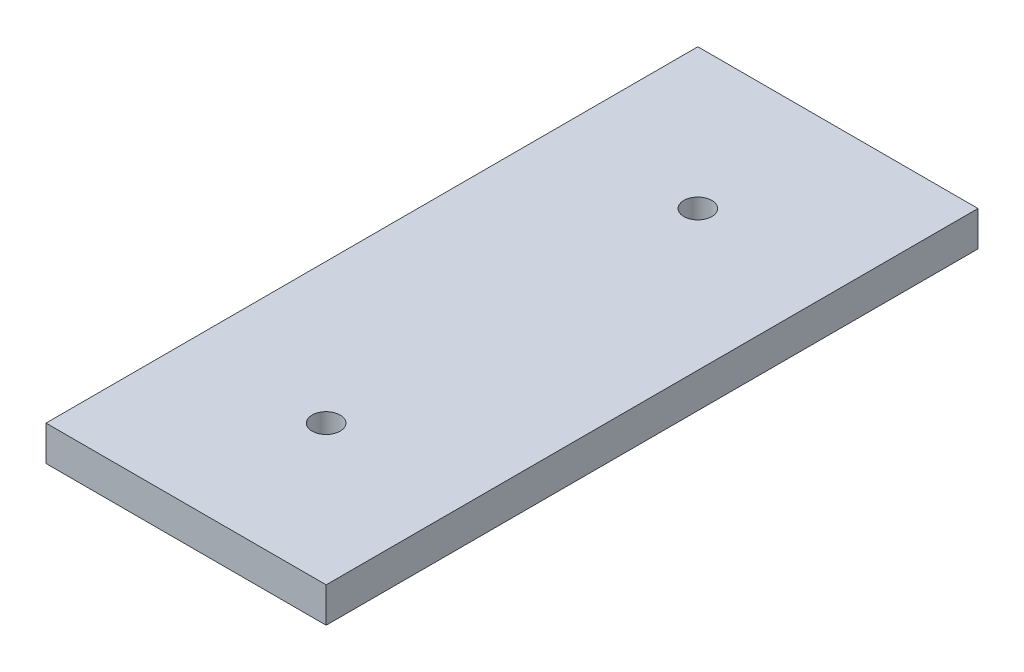
ISO-10303-21;
HEADER;
FILE_DESCRIPTION(('STEP AP214'),'2;1');
FILE_NAME('part.step','',(''),(''),'','','');
FILE_SCHEMA(('AUTOMOTIVE_DESIGN { 1 0 10303 214 1 1 1 1 }'));
ENDSEC;
DATA;
#1=APPLICATION_CONTEXT('core data for automotive mechanical design processes');
#2=APPLICATION_PROTOCOL_DEFINITION('international standard','automotive_design',2000,#1);
#3=PRODUCT_CONTEXT('',#1,'mechanical');
#4=PRODUCT('Part','Part','',(#3));
#5=PRODUCT_RELATED_PRODUCT_CATEGORY('part','',(#4));
#6=PRODUCT_DEFINITION_FORMATION('','',#4);
#7=PRODUCT_DEFINITION_CONTEXT('part definition',#1,'design');
#8=PRODUCT_DEFINITION('design','',#6,#7);
#9=PRODUCT_DEFINITION_SHAPE('','',#8);
#10=(LENGTH_UNIT() NAMED_UNIT(*) SI_UNIT(.MILLI.,.METRE.));
#11=(NAMED_UNIT(*) PLANE_ANGLE_UNIT() SI_UNIT($,.RADIAN.));
#12=(NAMED_UNIT(*) SI_UNIT($,.STERADIAN.) SOLID_ANGLE_UNIT());
#13=UNCERTAINTY_MEASURE_WITH_UNIT(LENGTH_MEASURE(1.E-05),#10,'distance_accuracy_value','');
#14=(GEOMETRIC_REPRESENTATION_CONTEXT(3) GLOBAL_UNCERTAINTY_ASSIGNED_CONTEXT((#13)) GLOBAL_UNIT_ASSIGNED_CONTEXT((#10,
#11,#12)) REPRESENTATION_CONTEXT('',''));
#15=CARTESIAN_POINT('',(0.,0.,0.));
#16=DIRECTION('',(0.,0.,1.));
#17=DIRECTION('',(1.,0.,0.));
#18=AXIS2_PLACEMENT_3D('',#15,#16,#17);
#19=CARTESIAN_POINT('',(0.,-2.5,-11.5342917352885));
#20=DIRECTION('',(0.,1.,0.));
#21=DIRECTION('',(0.,0.,1.));
#22=AXIS2_PLACEMENT_3D('',#19,#20,#21);
#23=PLANE('',#22);
#24=CARTESIAN_POINT('',(0.,-2.50000000000009,-24.0342917352885));
#25=DIRECTION('',(0.,1.,0.));
#26=DIRECTION('',(0.,0.,1.));
#27=AXIS2_PLACEMENT_3D('',#24,#25,#26);
#28=CIRCLE('',#27,1.);
#29=CARTESIAN_POINT('',(0.,-2.50000000000008,-23.0342917352885));
#30=VERTEX_POINT('',#29);
#31=EDGE_CURVE('E157',#30,#30,#28,.F.);
#32=ORIENTED_EDGE('',*,*,#31,.F.);
#33=EDGE_LOOP('',(#32));
#34=FACE_BOUND('',#33,.T.);
#35=DIRECTION('',(0.,0.,1.));
#36=VECTOR('',#35,1.);
#37=CARTESIAN_POINT('',(10.,-2.5,-11.5342917352885));
#38=LINE('',#37,#36);
#39=CARTESIAN_POINT('',(10.,-2.50000000000016,-34.0342917352885));
#40=VERTEX_POINT('',#39);
#41=CARTESIAN_POINT('',(10.,-2.5,12.5));
#42=VERTEX_POINT('',#41);
#43=EDGE_CURVE('E115',#40,#42,#38,.T.);
#44=ORIENTED_EDGE('',*,*,#43,.T.);
#45=DIRECTION('',(1.,0.,0.));
#46=VECTOR('',#45,1.);
#47=CARTESIAN_POINT('',(-9.99999999999999,-2.5,12.5));
#48=LINE('',#47,#46);
#49=CARTESIAN_POINT('',(-9.99999999999999,-2.5,12.5));
#50=VERTEX_POINT('',#49);
#51=EDGE_CURVE('E133',#50,#42,#48,.T.);
#52=ORIENTED_EDGE('',*,*,#51,.F.);
#53=DIRECTION('',(0.,0.,-1.));
#54=VECTOR('',#53,1.);
#55=CARTESIAN_POINT('',(-10.,-2.5,-11.5342917352885));
#56=LINE('',#55,#54);
#57=CARTESIAN_POINT('',(-10.,-2.50000000000016,-34.0342917352885));
#58=VERTEX_POINT('',#57);
#59=EDGE_CURVE('E109',#50,#58,#56,.T.);
#60=ORIENTED_EDGE('',*,*,#59,.T.);
#61=DIRECTION('',(1.,0.,0.));
#62=VECTOR('',#61,1.);
#63=CARTESIAN_POINT('',(0.,-2.50000000000016,-34.0342917352885));
#64=LINE('',#63,#62);
#65=EDGE_CURVE('E87',#58,#40,#64,.T.);
#66=ORIENTED_EDGE('',*,*,#65,.T.);
#67=EDGE_LOOP('',(#44,#52,#60,#66));
#68=FACE_BOUND('',#67,.T.);
#69=CARTESIAN_POINT('',(0.,-2.5,2.5));
#70=DIRECTION('',(0.,1.,0.));
#71=DIRECTION('',(0.,0.,1.));
#72=AXIS2_PLACEMENT_3D('',#69,#70,#71);
#73=CIRCLE('',#72,1.);
#74=CARTESIAN_POINT('',(0.,-2.5,3.5));
#75=VERTEX_POINT('',#74);
#76=EDGE_CURVE('E139',#75,#75,#73,.T.);
#77=ORIENTED_EDGE('',*,*,#76,.T.);
#78=EDGE_LOOP('',(#77));
#79=FACE_BOUND('',#78,.T.);
#80=ADVANCED_FACE('F68',(#34,#68,#79),#23,.F.);
#81=CARTESIAN_POINT('',(0.,0.,0.));
#82=DIRECTION('',(0.,-1.,0.));
#83=DIRECTION('',(0.,0.,-1.));
#84=AXIS2_PLACEMENT_3D('',#81,#82,#83);
#85=PLANE('',#84);
#86=CARTESIAN_POINT('',(0.,0.,-24.0342917352885));
#87=DIRECTION('',(0.,1.,0.));
#88=DIRECTION('',(0.,0.,1.));
#89=AXIS2_PLACEMENT_3D('',#86,#87,#88);
#90=CIRCLE('',#89,1.);
#91=CARTESIAN_POINT('',(0.,0.,-23.0342917352885));
#92=VERTEX_POINT('',#91);
#93=EDGE_CURVE('E72',#92,#92,#90,.F.);
#94=ORIENTED_EDGE('',*,*,#93,.T.);
#95=EDGE_LOOP('',(#94));
#96=FACE_BOUND('',#95,.T.);
#97=DIRECTION('',(0.,0.,1.));
#98=VECTOR('',#97,1.);
#99=CARTESIAN_POINT('',(-10.,-1.57859836313889E-13,-34.0342917352885));
#100=LINE('',#99,#98);
#101=CARTESIAN_POINT('',(-9.99999999999999,0.,12.5));
#102=VERTEX_POINT('',#101);
#103=CARTESIAN_POINT('',(-10.,-1.57859836313889E-13,-34.0342917352885));
#104=VERTEX_POINT('',#103);
#105=EDGE_CURVE('E105',#102,#104,#100,.F.);
#106=ORIENTED_EDGE('',*,*,#105,.F.);
#107=DIRECTION('',(1.,0.,0.));
#108=VECTOR('',#107,1.);
#109=CARTESIAN_POINT('',(-9.99999999999999,0.,12.5));
#110=LINE('',#109,#108);
#111=CARTESIAN_POINT('',(10.,0.,12.5));
#112=VERTEX_POINT('',#111);
#113=EDGE_CURVE('E132',#102,#112,#110,.T.);
#114=ORIENTED_EDGE('',*,*,#113,.T.);
#115=DIRECTION('',(0.,0.,-1.));
#116=VECTOR('',#115,1.);
#117=CARTESIAN_POINT('',(10.,0.,-11.5342917352885));
#118=LINE('',#117,#116);
#119=CARTESIAN_POINT('',(10.,-1.57859836313889E-13,-34.0342917352885));
#120=VERTEX_POINT('',#119);
#121=EDGE_CURVE('E120',#120,#112,#118,.F.);
#122=ORIENTED_EDGE('',*,*,#121,.F.);
#123=DIRECTION('',(-1.,0.,0.));
#124=VECTOR('',#123,1.);
#125=CARTESIAN_POINT('',(10.,-1.57859836313889E-13,-34.0342917352885));
#126=LINE('',#125,#124);
#127=EDGE_CURVE('E97',#104,#120,#126,.F.);
#128=ORIENTED_EDGE('',*,*,#127,.F.);
#129=EDGE_LOOP('',(#106,#114,#122,#128));
#130=FACE_BOUND('',#129,.T.);
#131=CARTESIAN_POINT('',(0.,0.,2.5));
#132=DIRECTION('',(0.,1.,0.));
#133=DIRECTION('',(0.,0.,1.));
#134=AXIS2_PLACEMENT_3D('',#131,#132,#133);
#135=CIRCLE('',#134,1.);
#136=CARTESIAN_POINT('',(0.,0.,3.5));
#137=VERTEX_POINT('',#136);
#138=EDGE_CURVE('E134',#137,#137,#135,.T.);
#139=ORIENTED_EDGE('',*,*,#138,.F.);
#140=EDGE_LOOP('',(#139));
#141=FACE_BOUND('',#140,.T.);
#142=ADVANCED_FACE('F70',(#96,#130,#141),#85,.F.);
#143=CARTESIAN_POINT('',(-10.,-2.50000000000016,-34.0342917352885));
#144=DIRECTION('',(1.,0.,0.));
#145=DIRECTION('',(0.,-1.,0.));
#146=AXIS2_PLACEMENT_3D('',#143,#144,#145);
#147=PLANE('',#146);
#148=ORIENTED_EDGE('',*,*,#59,.F.);
#149=DIRECTION('',(0.,1.,0.));
#150=VECTOR('',#149,1.);
#151=CARTESIAN_POINT('',(-9.99999999999999,-2.5,12.5));
#152=LINE('',#151,#150);
#153=EDGE_CURVE('E138',#50,#102,#152,.T.);
#154=ORIENTED_EDGE('',*,*,#153,.T.);
#155=ORIENTED_EDGE('',*,*,#105,.T.);
#156=DIRECTION('',(0.,1.,0.));
#157=VECTOR('',#156,1.);
#158=CARTESIAN_POINT('',(-10.,-2.50000000000016,-34.0342917352885));
#159=LINE('',#158,#157);
#160=EDGE_CURVE('E14',#58,#104,#159,.T.);
#161=ORIENTED_EDGE('',*,*,#160,.F.);
#162=EDGE_LOOP('',(#148,#154,#155,#161));
#163=FACE_BOUND('',#162,.T.);
#164=ADVANCED_FACE('F184',(#163),#147,.F.);
#165=CARTESIAN_POINT('',(10.,-2.5,-11.5342917352885));
#166=DIRECTION('',(-1.,0.,0.));
#167=DIRECTION('',(0.,1.,0.));
#168=AXIS2_PLACEMENT_3D('',#165,#166,#167);
#169=PLANE('',#168);
#170=ORIENTED_EDGE('',*,*,#121,.T.);
#171=DIRECTION('',(0.,1.,0.));
#172=VECTOR('',#171,1.);
#173=CARTESIAN_POINT('',(10.,-2.5,12.5));
#174=LINE('',#173,#172);
#175=EDGE_CURVE('E123',#42,#112,#174,.T.);
#176=ORIENTED_EDGE('',*,*,#175,.F.);
#177=ORIENTED_EDGE('',*,*,#43,.F.);
#178=DIRECTION('',(0.,1.,0.));
#179=VECTOR('',#178,1.);
#180=CARTESIAN_POINT('',(10.,-2.50000000000016,-34.0342917352885));
#181=LINE('',#180,#179);
#182=EDGE_CURVE('E78',#40,#120,#181,.T.);
#183=ORIENTED_EDGE('',*,*,#182,.T.);
#184=EDGE_LOOP('',(#170,#176,#177,#183));
#185=FACE_BOUND('',#184,.T.);
#186=ADVANCED_FACE('F122',(#185),#169,.F.);
#187=CARTESIAN_POINT('',(10.,-2.50000000000016,-34.0342917352885));
#188=DIRECTION('',(0.,0.,1.));
#189=DIRECTION('',(0.,-1.,0.));
#190=AXIS2_PLACEMENT_3D('',#187,#188,#189);
#191=PLANE('',#190);
#192=ORIENTED_EDGE('',*,*,#127,.T.);
#193=ORIENTED_EDGE('',*,*,#182,.F.);
#194=ORIENTED_EDGE('',*,*,#65,.F.);
#195=ORIENTED_EDGE('',*,*,#160,.T.);
#196=EDGE_LOOP('',(#192,#193,#194,#195));
#197=FACE_BOUND('',#196,.T.);
#198=ADVANCED_FACE('F168',(#197),#191,.F.);
#199=CARTESIAN_POINT('',(0.,-2.50000000000009,-24.0342917352885));
#200=DIRECTION('',(0.,1.,0.));
#201=DIRECTION('',(0.,0.,1.));
#202=AXIS2_PLACEMENT_3D('',#199,#200,#201);
#203=CYLINDRICAL_SURFACE('',#202,1.);
#204=ORIENTED_EDGE('',*,*,#31,.T.);
#205=EDGE_LOOP('',(#204));
#206=FACE_BOUND('',#205,.T.);
#207=ORIENTED_EDGE('',*,*,#93,.F.);
#208=EDGE_LOOP('',(#207));
#209=FACE_BOUND('',#208,.T.);
#210=ADVANCED_FACE('F166',(#206,#209),#203,.F.);
#211=CARTESIAN_POINT('',(-9.99999999999999,-2.5,12.5));
#212=DIRECTION('',(0.,0.,1.));
#213=DIRECTION('',(1.,0.,0.));
#214=AXIS2_PLACEMENT_3D('',#211,#212,#213);
#215=PLANE('',#214);
#216=ORIENTED_EDGE('',*,*,#113,.F.);
#217=ORIENTED_EDGE('',*,*,#153,.F.);
#218=ORIENTED_EDGE('',*,*,#51,.T.);
#219=ORIENTED_EDGE('',*,*,#175,.T.);
#220=EDGE_LOOP('',(#216,#217,#218,#219));
#221=FACE_BOUND('',#220,.T.);
#222=ADVANCED_FACE('F131',(#221),#215,.T.);
#223=CARTESIAN_POINT('',(0.,-2.5,2.5));
#224=DIRECTION('',(0.,1.,0.));
#225=DIRECTION('',(0.,0.,1.));
#226=AXIS2_PLACEMENT_3D('',#223,#224,#225);
#227=CYLINDRICAL_SURFACE('',#226,1.);
#228=ORIENTED_EDGE('',*,*,#76,.F.);
#229=EDGE_LOOP('',(#228));
#230=FACE_BOUND('',#229,.T.);
#231=ORIENTED_EDGE('',*,*,#138,.T.);
#232=EDGE_LOOP('',(#231));
#233=FACE_BOUND('',#232,.T.);
#234=ADVANCED_FACE('F174',(#230,#233),#227,.F.);
#235=CLOSED_SHELL('',(#80,#142,#164,#186,#198,#210,#222,#234));
#236=MANIFOLD_SOLID_BREP('B2',#235);
#237=ADVANCED_BREP_SHAPE_REPRESENTATION('',(#18,#236),#14);
#238=SHAPE_DEFINITION_REPRESENTATION(#9,#237);
ENDSEC;
END-ISO-10303-21;
